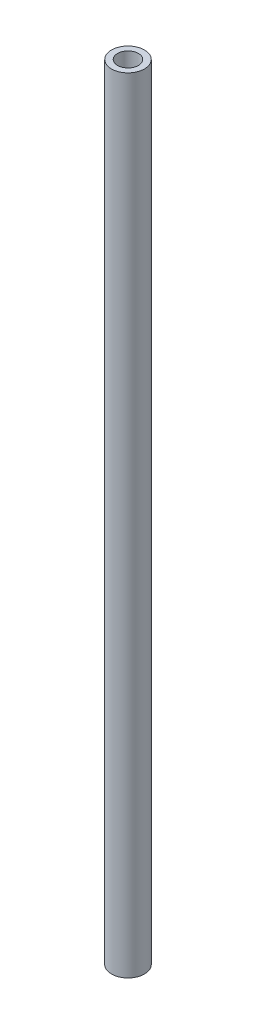
ISO-10303-21;
HEADER;
FILE_DESCRIPTION(('STEP AP214'),'2;1');
FILE_NAME('part.step','',(''),(''),'','','');
FILE_SCHEMA(('AUTOMOTIVE_DESIGN { 1 0 10303 214 1 1 1 1 }'));
ENDSEC;
DATA;
#1=APPLICATION_CONTEXT('core data for automotive mechanical design processes');
#2=APPLICATION_PROTOCOL_DEFINITION('international standard','automotive_design',2000,#1);
#3=PRODUCT_CONTEXT('',#1,'mechanical');
#4=PRODUCT('Part','Part','',(#3));
#5=PRODUCT_RELATED_PRODUCT_CATEGORY('part','',(#4));
#6=PRODUCT_DEFINITION_FORMATION('','',#4);
#7=PRODUCT_DEFINITION_CONTEXT('part definition',#1,'design');
#8=PRODUCT_DEFINITION('design','',#6,#7);
#9=PRODUCT_DEFINITION_SHAPE('','',#8);
#10=(LENGTH_UNIT() NAMED_UNIT(*) SI_UNIT(.MILLI.,.METRE.));
#11=(NAMED_UNIT(*) PLANE_ANGLE_UNIT() SI_UNIT($,.RADIAN.));
#12=(NAMED_UNIT(*) SI_UNIT($,.STERADIAN.) SOLID_ANGLE_UNIT());
#13=UNCERTAINTY_MEASURE_WITH_UNIT(LENGTH_MEASURE(1.E-05),#10,'distance_accuracy_value','');
#14=(GEOMETRIC_REPRESENTATION_CONTEXT(3) GLOBAL_UNCERTAINTY_ASSIGNED_CONTEXT((#13)) GLOBAL_UNIT_ASSIGNED_CONTEXT((#10,
#11,#12)) REPRESENTATION_CONTEXT('',''));
#15=CARTESIAN_POINT('',(0.,0.,0.));
#16=DIRECTION('',(0.,0.,1.));
#17=DIRECTION('',(1.,0.,0.));
#18=AXIS2_PLACEMENT_3D('',#15,#16,#17);
#19=CARTESIAN_POINT('',(0.,150.,0.));
#20=DIRECTION('',(0.,1.,0.));
#21=DIRECTION('',(0.,0.,1.));
#22=AXIS2_PLACEMENT_3D('',#19,#20,#21);
#23=PLANE('',#22);
#24=CARTESIAN_POINT('',(0.,150.,0.));
#25=DIRECTION('',(0.,1.,0.));
#26=DIRECTION('',(0.,0.,1.));
#27=AXIS2_PLACEMENT_3D('',#24,#25,#26);
#28=CIRCLE('',#27,3.15);
#29=CARTESIAN_POINT('',(0.,150.,3.15));
#30=VERTEX_POINT('',#29);
#31=EDGE_CURVE('E10',#30,#30,#28,.T.);
#32=ORIENTED_EDGE('',*,*,#31,.T.);
#33=EDGE_LOOP('',(#32));
#34=FACE_BOUND('',#33,.T.);
#35=CARTESIAN_POINT('',(0.,150.,0.));
#36=DIRECTION('',(0.,1.,0.));
#37=DIRECTION('',(0.,0.,1.));
#38=AXIS2_PLACEMENT_3D('',#35,#36,#37);
#39=CIRCLE('',#38,2.);
#40=CARTESIAN_POINT('',(0.,150.,2.));
#41=VERTEX_POINT('',#40);
#42=EDGE_CURVE('E50',#41,#41,#39,.T.);
#43=ORIENTED_EDGE('',*,*,#42,.F.);
#44=EDGE_LOOP('',(#43));
#45=FACE_BOUND('',#44,.T.);
#46=ADVANCED_FACE('F37',(#34,#45),#23,.T.);
#47=CARTESIAN_POINT('',(0.,0.,0.));
#48=DIRECTION('',(0.,1.,0.));
#49=DIRECTION('',(0.,0.,1.));
#50=AXIS2_PLACEMENT_3D('',#47,#48,#49);
#51=PLANE('',#50);
#52=CARTESIAN_POINT('',(0.,0.,0.));
#53=DIRECTION('',(0.,1.,0.));
#54=DIRECTION('',(0.,0.,1.));
#55=AXIS2_PLACEMENT_3D('',#52,#53,#54);
#56=CIRCLE('',#55,3.15);
#57=CARTESIAN_POINT('',(0.,0.,3.15));
#58=VERTEX_POINT('',#57);
#59=EDGE_CURVE('E41',#58,#58,#56,.T.);
#60=ORIENTED_EDGE('',*,*,#59,.F.);
#61=EDGE_LOOP('',(#60));
#62=FACE_BOUND('',#61,.T.);
#63=CARTESIAN_POINT('',(0.,0.,0.));
#64=DIRECTION('',(0.,1.,0.));
#65=DIRECTION('',(0.,0.,1.));
#66=AXIS2_PLACEMENT_3D('',#63,#64,#65);
#67=CIRCLE('',#66,2.);
#68=CARTESIAN_POINT('',(0.,0.,2.));
#69=VERTEX_POINT('',#68);
#70=EDGE_CURVE('E52',#69,#69,#67,.T.);
#71=ORIENTED_EDGE('',*,*,#70,.T.);
#72=EDGE_LOOP('',(#71));
#73=FACE_BOUND('',#72,.T.);
#74=ADVANCED_FACE('F64',(#62,#73),#51,.F.);
#75=CARTESIAN_POINT('',(0.,150.,0.));
#76=DIRECTION('',(0.,-1.,0.));
#77=DIRECTION('',(0.,0.,-1.));
#78=AXIS2_PLACEMENT_3D('',#75,#76,#77);
#79=CYLINDRICAL_SURFACE('',#78,3.15);
#80=ORIENTED_EDGE('',*,*,#31,.F.);
#81=EDGE_LOOP('',(#80));
#82=FACE_BOUND('',#81,.T.);
#83=ORIENTED_EDGE('',*,*,#59,.T.);
#84=EDGE_LOOP('',(#83));
#85=FACE_BOUND('',#84,.T.);
#86=ADVANCED_FACE('F39',(#82,#85),#79,.T.);
#87=CARTESIAN_POINT('',(0.,150.,0.));
#88=DIRECTION('',(0.,-1.,0.));
#89=DIRECTION('',(0.,0.,-1.));
#90=AXIS2_PLACEMENT_3D('',#87,#88,#89);
#91=CYLINDRICAL_SURFACE('',#90,2.);
#92=ORIENTED_EDGE('',*,*,#42,.T.);
#93=EDGE_LOOP('',(#92));
#94=FACE_BOUND('',#93,.T.);
#95=ORIENTED_EDGE('',*,*,#70,.F.);
#96=EDGE_LOOP('',(#95));
#97=FACE_BOUND('',#96,.T.);
#98=ADVANCED_FACE('F60',(#94,#97),#91,.F.);
#99=CLOSED_SHELL('',(#46,#74,#86,#98));
#100=MANIFOLD_SOLID_BREP('B2',#99);
#101=ADVANCED_BREP_SHAPE_REPRESENTATION('',(#18,#100),#14);
#102=SHAPE_DEFINITION_REPRESENTATION(#9,#101);
ENDSEC;
END-ISO-10303-21;
